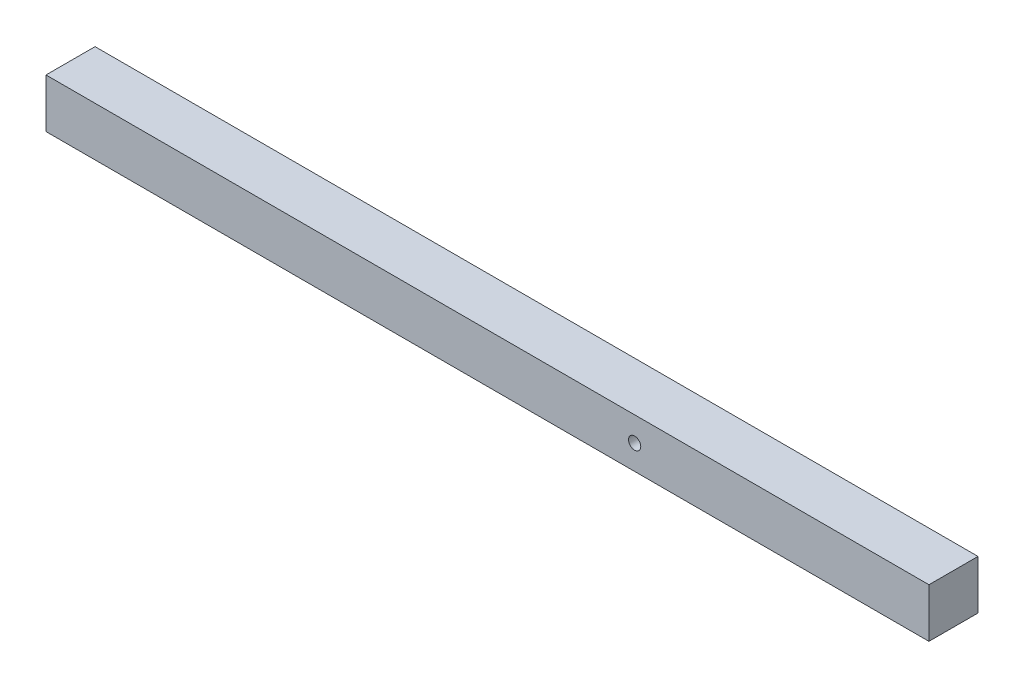
ISO-10303-21;
HEADER;
FILE_DESCRIPTION(('STEP AP214'),'2;1');
FILE_NAME('part.step','',(''),(''),'','','');
FILE_SCHEMA(('AUTOMOTIVE_DESIGN { 1 0 10303 214 1 1 1 1 }'));
ENDSEC;
DATA;
#1=APPLICATION_CONTEXT('core data for automotive mechanical design processes');
#2=APPLICATION_PROTOCOL_DEFINITION('international standard','automotive_design',2000,#1);
#3=PRODUCT_CONTEXT('',#1,'mechanical');
#4=PRODUCT('Part','Part','',(#3));
#5=PRODUCT_RELATED_PRODUCT_CATEGORY('part','',(#4));
#6=PRODUCT_DEFINITION_FORMATION('','',#4);
#7=PRODUCT_DEFINITION_CONTEXT('part definition',#1,'design');
#8=PRODUCT_DEFINITION('design','',#6,#7);
#9=PRODUCT_DEFINITION_SHAPE('','',#8);
#10=(LENGTH_UNIT() NAMED_UNIT(*) SI_UNIT(.MILLI.,.METRE.));
#11=(NAMED_UNIT(*) PLANE_ANGLE_UNIT() SI_UNIT($,.RADIAN.));
#12=(NAMED_UNIT(*) SI_UNIT($,.STERADIAN.) SOLID_ANGLE_UNIT());
#13=UNCERTAINTY_MEASURE_WITH_UNIT(LENGTH_MEASURE(1.E-05),#10,'distance_accuracy_value','');
#14=(GEOMETRIC_REPRESENTATION_CONTEXT(3) GLOBAL_UNCERTAINTY_ASSIGNED_CONTEXT((#13)) GLOBAL_UNIT_ASSIGNED_CONTEXT((#10,
#11,#12)) REPRESENTATION_CONTEXT('',''));
#15=CARTESIAN_POINT('',(0.,0.,0.));
#16=DIRECTION('',(0.,0.,1.));
#17=DIRECTION('',(1.,0.,0.));
#18=AXIS2_PLACEMENT_3D('',#15,#16,#17);
#19=CARTESIAN_POINT('',(-457.2,50.8,-25.4));
#20=DIRECTION('',(0.,0.,1.));
#21=DIRECTION('',(1.,0.,0.));
#22=AXIS2_PLACEMENT_3D('',#19,#20,#21);
#23=PLANE('',#22);
#24=DIRECTION('',(-1.,0.,0.));
#25=VECTOR('',#24,1.);
#26=CARTESIAN_POINT('',(-457.2,0.,-25.4));
#27=LINE('',#26,#25);
#28=CARTESIAN_POINT('',(457.2,0.,-25.4));
#29=VERTEX_POINT('',#28);
#30=CARTESIAN_POINT('',(-457.2,0.,-25.4));
#31=VERTEX_POINT('',#30);
#32=EDGE_CURVE('E91',#29,#31,#27,.T.);
#33=ORIENTED_EDGE('',*,*,#32,.T.);
#34=DIRECTION('',(0.,-1.,0.));
#35=VECTOR('',#34,1.);
#36=CARTESIAN_POINT('',(-457.2,50.8,-25.4));
#37=LINE('',#36,#35);
#38=CARTESIAN_POINT('',(-457.2,50.8,-25.4));
#39=VERTEX_POINT('',#38);
#40=EDGE_CURVE('E44',#39,#31,#37,.T.);
#41=ORIENTED_EDGE('',*,*,#40,.F.);
#42=DIRECTION('',(-1.,0.,0.));
#43=VECTOR('',#42,1.);
#44=CARTESIAN_POINT('',(-457.2,50.8,-25.4));
#45=LINE('',#44,#43);
#46=CARTESIAN_POINT('',(457.2,50.8,-25.4));
#47=VERTEX_POINT('',#46);
#48=EDGE_CURVE('E82',#47,#39,#45,.T.);
#49=ORIENTED_EDGE('',*,*,#48,.F.);
#50=DIRECTION('',(0.,-1.,0.));
#51=VECTOR('',#50,1.);
#52=CARTESIAN_POINT('',(457.2,50.8,-25.4));
#53=LINE('',#52,#51);
#54=EDGE_CURVE('E11',#47,#29,#53,.T.);
#55=ORIENTED_EDGE('',*,*,#54,.T.);
#56=EDGE_LOOP('',(#33,#41,#49,#55));
#57=FACE_BOUND('',#56,.T.);
#58=CARTESIAN_POINT('',(152.4,25.4,-25.4));
#59=DIRECTION('',(0.,0.,1.));
#60=DIRECTION('',(1.,0.,0.));
#61=AXIS2_PLACEMENT_3D('',#58,#59,#60);
#62=CIRCLE('',#61,6.35);
#63=CARTESIAN_POINT('',(158.75,25.4,-25.4));
#64=VERTEX_POINT('',#63);
#65=EDGE_CURVE('E116',#64,#64,#62,.T.);
#66=ORIENTED_EDGE('',*,*,#65,.T.);
#67=EDGE_LOOP('',(#66));
#68=FACE_BOUND('',#67,.T.);
#69=ADVANCED_FACE('F35',(#57,#68),#23,.F.);
#70=CARTESIAN_POINT('',(-457.2,50.8,25.4));
#71=DIRECTION('',(0.,0.,-1.));
#72=DIRECTION('',(-1.,0.,0.));
#73=AXIS2_PLACEMENT_3D('',#70,#71,#72);
#74=PLANE('',#73);
#75=DIRECTION('',(1.,0.,0.));
#76=VECTOR('',#75,1.);
#77=CARTESIAN_POINT('',(-457.2,0.,25.4));
#78=LINE('',#77,#76);
#79=CARTESIAN_POINT('',(-457.2,0.,25.4));
#80=VERTEX_POINT('',#79);
#81=CARTESIAN_POINT('',(457.2,0.,25.4));
#82=VERTEX_POINT('',#81);
#83=EDGE_CURVE('E75',#80,#82,#78,.T.);
#84=ORIENTED_EDGE('',*,*,#83,.T.);
#85=DIRECTION('',(0.,-1.,0.));
#86=VECTOR('',#85,1.);
#87=CARTESIAN_POINT('',(457.2,50.8,25.4));
#88=LINE('',#87,#86);
#89=CARTESIAN_POINT('',(457.2,50.8,25.4));
#90=VERTEX_POINT('',#89);
#91=EDGE_CURVE('E95',#90,#82,#88,.T.);
#92=ORIENTED_EDGE('',*,*,#91,.F.);
#93=DIRECTION('',(1.,0.,0.));
#94=VECTOR('',#93,1.);
#95=CARTESIAN_POINT('',(-457.2,50.8,25.4));
#96=LINE('',#95,#94);
#97=CARTESIAN_POINT('',(-457.2,50.8,25.4));
#98=VERTEX_POINT('',#97);
#99=EDGE_CURVE('E52',#98,#90,#96,.T.);
#100=ORIENTED_EDGE('',*,*,#99,.F.);
#101=DIRECTION('',(0.,-1.,0.));
#102=VECTOR('',#101,1.);
#103=CARTESIAN_POINT('',(-457.2,50.8,25.4));
#104=LINE('',#103,#102);
#105=EDGE_CURVE('E92',#98,#80,#104,.T.);
#106=ORIENTED_EDGE('',*,*,#105,.T.);
#107=EDGE_LOOP('',(#84,#92,#100,#106));
#108=FACE_BOUND('',#107,.T.);
#109=CARTESIAN_POINT('',(152.4,25.4,25.4));
#110=DIRECTION('',(0.,0.,1.));
#111=DIRECTION('',(1.,0.,0.));
#112=AXIS2_PLACEMENT_3D('',#109,#110,#111);
#113=CIRCLE('',#112,6.35);
#114=CARTESIAN_POINT('',(158.75,25.4,25.4));
#115=VERTEX_POINT('',#114);
#116=EDGE_CURVE('E102',#115,#115,#113,.T.);
#117=ORIENTED_EDGE('',*,*,#116,.F.);
#118=EDGE_LOOP('',(#117));
#119=FACE_BOUND('',#118,.T.);
#120=ADVANCED_FACE('F107',(#108,#119),#74,.F.);
#121=CARTESIAN_POINT('',(457.2,50.8,25.4));
#122=DIRECTION('',(-1.,0.,0.));
#123=DIRECTION('',(0.,0.,1.));
#124=AXIS2_PLACEMENT_3D('',#121,#122,#123);
#125=PLANE('',#124);
#126=DIRECTION('',(0.,0.,-1.));
#127=VECTOR('',#126,1.);
#128=CARTESIAN_POINT('',(457.2,0.,25.4));
#129=LINE('',#128,#127);
#130=EDGE_CURVE('E99',#82,#29,#129,.T.);
#131=ORIENTED_EDGE('',*,*,#130,.T.);
#132=ORIENTED_EDGE('',*,*,#54,.F.);
#133=DIRECTION('',(0.,0.,-1.));
#134=VECTOR('',#133,1.);
#135=CARTESIAN_POINT('',(457.2,50.8,25.4));
#136=LINE('',#135,#134);
#137=EDGE_CURVE('E87',#90,#47,#136,.T.);
#138=ORIENTED_EDGE('',*,*,#137,.F.);
#139=ORIENTED_EDGE('',*,*,#91,.T.);
#140=EDGE_LOOP('',(#131,#132,#138,#139));
#141=FACE_BOUND('',#140,.T.);
#142=ADVANCED_FACE('F37',(#141),#125,.F.);
#143=CARTESIAN_POINT('',(-457.2,50.8,25.4));
#144=DIRECTION('',(1.,0.,0.));
#145=DIRECTION('',(0.,0.,-1.));
#146=AXIS2_PLACEMENT_3D('',#143,#144,#145);
#147=PLANE('',#146);
#148=DIRECTION('',(0.,0.,1.));
#149=VECTOR('',#148,1.);
#150=CARTESIAN_POINT('',(-457.2,0.,25.4));
#151=LINE('',#150,#149);
#152=EDGE_CURVE('E69',#31,#80,#151,.T.);
#153=ORIENTED_EDGE('',*,*,#152,.T.);
#154=ORIENTED_EDGE('',*,*,#105,.F.);
#155=DIRECTION('',(0.,0.,1.));
#156=VECTOR('',#155,1.);
#157=CARTESIAN_POINT('',(-457.2,50.8,25.4));
#158=LINE('',#157,#156);
#159=EDGE_CURVE('E85',#39,#98,#158,.T.);
#160=ORIENTED_EDGE('',*,*,#159,.F.);
#161=ORIENTED_EDGE('',*,*,#40,.T.);
#162=EDGE_LOOP('',(#153,#154,#160,#161));
#163=FACE_BOUND('',#162,.T.);
#164=ADVANCED_FACE('F93',(#163),#147,.F.);
#165=CARTESIAN_POINT('',(0.,50.8,0.));
#166=DIRECTION('',(0.,-1.,0.));
#167=DIRECTION('',(0.,0.,-1.));
#168=AXIS2_PLACEMENT_3D('',#165,#166,#167);
#169=PLANE('',#168);
#170=ORIENTED_EDGE('',*,*,#137,.T.);
#171=ORIENTED_EDGE('',*,*,#48,.T.);
#172=ORIENTED_EDGE('',*,*,#159,.T.);
#173=ORIENTED_EDGE('',*,*,#99,.T.);
#174=EDGE_LOOP('',(#170,#171,#172,#173));
#175=FACE_BOUND('',#174,.T.);
#176=ADVANCED_FACE('F83',(#175),#169,.F.);
#177=CARTESIAN_POINT('',(0.,0.,0.));
#178=DIRECTION('',(0.,-1.,0.));
#179=DIRECTION('',(0.,0.,-1.));
#180=AXIS2_PLACEMENT_3D('',#177,#178,#179);
#181=PLANE('',#180);
#182=ORIENTED_EDGE('',*,*,#130,.F.);
#183=ORIENTED_EDGE('',*,*,#83,.F.);
#184=ORIENTED_EDGE('',*,*,#152,.F.);
#185=ORIENTED_EDGE('',*,*,#32,.F.);
#186=EDGE_LOOP('',(#182,#183,#184,#185));
#187=FACE_BOUND('',#186,.T.);
#188=ADVANCED_FACE('F111',(#187),#181,.T.);
#189=CARTESIAN_POINT('',(152.4,25.4,25.4));
#190=DIRECTION('',(0.,0.,-1.));
#191=DIRECTION('',(-1.,0.,0.));
#192=AXIS2_PLACEMENT_3D('',#189,#190,#191);
#193=CYLINDRICAL_SURFACE('',#192,6.35);
#194=ORIENTED_EDGE('',*,*,#116,.T.);
#195=EDGE_LOOP('',(#194));
#196=FACE_BOUND('',#195,.T.);
#197=ORIENTED_EDGE('',*,*,#65,.F.);
#198=EDGE_LOOP('',(#197));
#199=FACE_BOUND('',#198,.T.);
#200=ADVANCED_FACE('F120',(#196,#199),#193,.F.);
#201=CLOSED_SHELL('',(#69,#120,#142,#164,#176,#188,#200));
#202=MANIFOLD_SOLID_BREP('B2',#201);
#203=ADVANCED_BREP_SHAPE_REPRESENTATION('',(#18,#202),#14);
#204=SHAPE_DEFINITION_REPRESENTATION(#9,#203);
ENDSEC;
END-ISO-10303-21;
